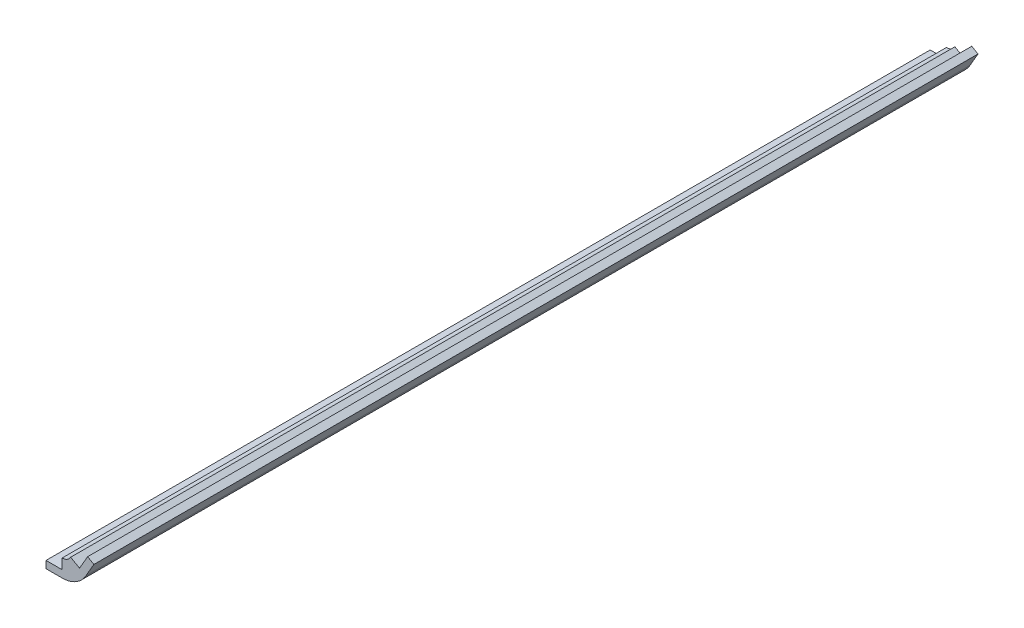
ISO-10303-21;
HEADER;
FILE_DESCRIPTION(('STEP AP214'),'2;1');
FILE_NAME('part.step','',(''),(''),'','','');
FILE_SCHEMA(('AUTOMOTIVE_DESIGN { 1 0 10303 214 1 1 1 1 }'));
ENDSEC;
DATA;
#1=APPLICATION_CONTEXT('core data for automotive mechanical design processes');
#2=APPLICATION_PROTOCOL_DEFINITION('international standard','automotive_design',2000,#1);
#3=PRODUCT_CONTEXT('',#1,'mechanical');
#4=PRODUCT('Part','Part','',(#3));
#5=PRODUCT_RELATED_PRODUCT_CATEGORY('part','',(#4));
#6=PRODUCT_DEFINITION_FORMATION('','',#4);
#7=PRODUCT_DEFINITION_CONTEXT('part definition',#1,'design');
#8=PRODUCT_DEFINITION('design','',#6,#7);
#9=PRODUCT_DEFINITION_SHAPE('','',#8);
#10=(LENGTH_UNIT() NAMED_UNIT(*) SI_UNIT(.MILLI.,.METRE.));
#11=(NAMED_UNIT(*) PLANE_ANGLE_UNIT() SI_UNIT($,.RADIAN.));
#12=(NAMED_UNIT(*) SI_UNIT($,.STERADIAN.) SOLID_ANGLE_UNIT());
#13=UNCERTAINTY_MEASURE_WITH_UNIT(LENGTH_MEASURE(1.E-05),#10,'distance_accuracy_value','');
#14=(GEOMETRIC_REPRESENTATION_CONTEXT(3) GLOBAL_UNCERTAINTY_ASSIGNED_CONTEXT((#13)) GLOBAL_UNIT_ASSIGNED_CONTEXT((#10,
#11,#12)) REPRESENTATION_CONTEXT('',''));
#15=CARTESIAN_POINT('',(0.,0.,0.));
#16=DIRECTION('',(0.,0.,1.));
#17=DIRECTION('',(1.,0.,0.));
#18=AXIS2_PLACEMENT_3D('',#15,#16,#17);
#19=CARTESIAN_POINT('',(-7.3025,-1.500000048,130.175));
#20=DIRECTION('',(1.,0.,0.));
#21=DIRECTION('',(0.,0.,-1.));
#22=AXIS2_PLACEMENT_3D('',#19,#20,#21);
#23=PLANE('',#22);
#24=DIRECTION('',(0.,-1.,0.));
#25=VECTOR('',#24,1.);
#26=CARTESIAN_POINT('',(-7.3025,-1.500000048,-130.175));
#27=LINE('',#26,#25);
#28=CARTESIAN_POINT('',(-7.3025,-1.500000048,-130.175));
#29=VERTEX_POINT('',#28);
#30=CARTESIAN_POINT('',(-7.3025,-3.621225168,-130.175));
#31=VERTEX_POINT('',#30);
#32=EDGE_CURVE('E88',#29,#31,#27,.T.);
#33=ORIENTED_EDGE('',*,*,#32,.T.);
#34=DIRECTION('',(0.,0.,-1.));
#35=VECTOR('',#34,1.);
#36=CARTESIAN_POINT('',(-7.3025,-3.621225168,130.175));
#37=LINE('',#36,#35);
#38=CARTESIAN_POINT('',(-7.3025,-3.621225168,130.175));
#39=VERTEX_POINT('',#38);
#40=EDGE_CURVE('E11',#39,#31,#37,.T.);
#41=ORIENTED_EDGE('',*,*,#40,.F.);
#42=DIRECTION('',(0.,-1.,0.));
#43=VECTOR('',#42,1.);
#44=CARTESIAN_POINT('',(-7.3025,-1.500000048,130.175));
#45=LINE('',#44,#43);
#46=CARTESIAN_POINT('',(-7.3025,-1.500000048,130.175));
#47=VERTEX_POINT('',#46);
#48=EDGE_CURVE('E82',#47,#39,#45,.T.);
#49=ORIENTED_EDGE('',*,*,#48,.F.);
#50=DIRECTION('',(0.,0.,-1.));
#51=VECTOR('',#50,1.);
#52=CARTESIAN_POINT('',(-7.3025,-1.500000048,130.175));
#53=LINE('',#52,#51);
#54=EDGE_CURVE('E77',#47,#29,#53,.T.);
#55=ORIENTED_EDGE('',*,*,#54,.T.);
#56=EDGE_LOOP('',(#33,#41,#49,#55));
#57=FACE_BOUND('',#56,.T.);
#58=ADVANCED_FACE('F37',(#57),#23,.F.);
#59=CARTESIAN_POINT('',(-7.3025,-3.621225168,130.175));
#60=DIRECTION('',(0.,1.,0.));
#61=DIRECTION('',(0.,0.,1.));
#62=AXIS2_PLACEMENT_3D('',#59,#60,#61);
#63=PLANE('',#62);
#64=DIRECTION('',(1.,0.,0.));
#65=VECTOR('',#64,1.);
#66=CARTESIAN_POINT('',(-7.3025,-3.621225168,-130.175));
#67=LINE('',#66,#65);
#68=CARTESIAN_POINT('',(-2.54,-3.621225168,-130.175));
#69=VERTEX_POINT('',#68);
#70=EDGE_CURVE('E83',#31,#69,#67,.T.);
#71=ORIENTED_EDGE('',*,*,#70,.T.);
#72=DIRECTION('',(0.,0.,-1.));
#73=VECTOR('',#72,1.);
#74=CARTESIAN_POINT('',(-2.54,-3.621225168,130.175));
#75=LINE('',#74,#73);
#76=CARTESIAN_POINT('',(-2.54,-3.621225168,130.175));
#77=VERTEX_POINT('',#76);
#78=EDGE_CURVE('E46',#77,#69,#75,.T.);
#79=ORIENTED_EDGE('',*,*,#78,.F.);
#80=DIRECTION('',(1.,0.,0.));
#81=VECTOR('',#80,1.);
#82=CARTESIAN_POINT('',(-7.3025,-3.621225168,130.175));
#83=LINE('',#82,#81);
#84=EDGE_CURVE('E130',#39,#77,#83,.T.);
#85=ORIENTED_EDGE('',*,*,#84,.F.);
#86=ORIENTED_EDGE('',*,*,#40,.T.);
#87=EDGE_LOOP('',(#71,#79,#85,#86));
#88=FACE_BOUND('',#87,.T.);
#89=ADVANCED_FACE('F129',(#88),#63,.F.);
#90=CARTESIAN_POINT('',(-7.3025,-1.500000048,130.175));
#91=DIRECTION('',(0.,-1.,0.));
#92=DIRECTION('',(1.,0.,0.));
#93=AXIS2_PLACEMENT_3D('',#90,#91,#92);
#94=PLANE('',#93);
#95=DIRECTION('',(-1.,0.,0.));
#96=VECTOR('',#95,1.);
#97=CARTESIAN_POINT('',(-7.3025,-1.500000048,-130.175));
#98=LINE('',#97,#96);
#99=CARTESIAN_POINT('',(-2.54,-1.500000048,-130.175));
#100=VERTEX_POINT('',#99);
#101=EDGE_CURVE('E74',#100,#29,#98,.T.);
#102=ORIENTED_EDGE('',*,*,#101,.T.);
#103=ORIENTED_EDGE('',*,*,#54,.F.);
#104=DIRECTION('',(-1.,0.,0.));
#105=VECTOR('',#104,1.);
#106=CARTESIAN_POINT('',(-7.3025,-1.500000048,130.175));
#107=LINE('',#106,#105);
#108=CARTESIAN_POINT('',(-2.54,-1.500000048,130.175));
#109=VERTEX_POINT('',#108);
#110=EDGE_CURVE('E54',#109,#47,#107,.T.);
#111=ORIENTED_EDGE('',*,*,#110,.F.);
#112=DIRECTION('',(0.,0.,-1.));
#113=VECTOR('',#112,1.);
#114=CARTESIAN_POINT('',(-2.54,-1.500000048,130.175));
#115=LINE('',#114,#113);
#116=EDGE_CURVE('E79',#109,#100,#115,.T.);
#117=ORIENTED_EDGE('',*,*,#116,.T.);
#118=EDGE_LOOP('',(#102,#103,#111,#117));
#119=FACE_BOUND('',#118,.T.);
#120=ADVANCED_FACE('F76',(#119),#94,.F.);
#121=CARTESIAN_POINT('',(0.,0.,130.175));
#122=DIRECTION('',(0.,0.,1.));
#123=DIRECTION('',(1.,0.,0.));
#124=AXIS2_PLACEMENT_3D('',#121,#122,#123);
#125=PLANE('',#124);
#126=DIRECTION('',(-0.499999999999998,-0.86602540378444,0.));
#127=VECTOR('',#126,1.);
#128=CARTESIAN_POINT('',(4.95028814724586,5.57415048713588,130.175));
#129=LINE('',#128,#127);
#130=CARTESIAN_POINT('',(4.95028814724586,5.57415048713588,130.175));
#131=VERTEX_POINT('',#130);
#132=CARTESIAN_POINT('',(2.56903814724587,1.44970450161248,130.175));
#133=VERTEX_POINT('',#132);
#134=EDGE_CURVE('E170',#131,#133,#129,.T.);
#135=ORIENTED_EDGE('',*,*,#134,.T.);
#136=DIRECTION('',(-0.86602540378444,0.499999999999998,0.));
#137=VECTOR('',#136,1.);
#138=CARTESIAN_POINT('',(2.56903814724587,1.44970450161248,130.175));
#139=LINE('',#138,#137);
#140=CARTESIAN_POINT('',(-0.0290381472458851,2.94970454961247,130.175));
#141=VERTEX_POINT('',#140);
#142=EDGE_CURVE('E152',#133,#141,#139,.T.);
#143=ORIENTED_EDGE('',*,*,#142,.T.);
#144=CARTESIAN_POINT('',(-2.54,4.39940905122494,130.175));
#145=DIRECTION('',(0.,0.,-1.));
#146=DIRECTION('',(-1.,0.,0.));
#147=AXIS2_PLACEMENT_3D('',#144,#145,#146);
#148=CIRCLE('',#147,2.89940900322494);
#149=CARTESIAN_POINT('',(-2.54,1.500000048,130.175));
#150=VERTEX_POINT('',#149);
#151=EDGE_CURVE('E156',#141,#150,#148,.T.);
#152=ORIENTED_EDGE('',*,*,#151,.T.);
#153=DIRECTION('',(0.,-1.,0.));
#154=VECTOR('',#153,1.);
#155=CARTESIAN_POINT('',(-2.54,1.500000048,130.175));
#156=LINE('',#155,#154);
#157=EDGE_CURVE('E179',#150,#109,#156,.T.);
#158=ORIENTED_EDGE('',*,*,#157,.T.);
#159=ORIENTED_EDGE('',*,*,#110,.T.);
#160=ORIENTED_EDGE('',*,*,#48,.T.);
#161=ORIENTED_EDGE('',*,*,#84,.T.);
#162=CARTESIAN_POINT('',(-2.54,4.39940905122494,130.175));
#163=DIRECTION('',(0.,0.,1.));
#164=DIRECTION('',(-1.,0.,0.));
#165=AXIS2_PLACEMENT_3D('',#162,#163,#164);
#166=CIRCLE('',#165,8.02063421922494);
#167=CARTESIAN_POINT('',(4.40607298831157,0.389091941612482,130.175));
#168=VERTEX_POINT('',#167);
#169=EDGE_CURVE('E120',#77,#168,#166,.T.);
#170=ORIENTED_EDGE('',*,*,#169,.T.);
#171=DIRECTION('',(0.499999999999998,0.86602540378444,0.));
#172=VECTOR('',#171,1.);
#173=CARTESIAN_POINT('',(6.78732298831156,4.51353792713588,130.175));
#174=LINE('',#173,#172);
#175=CARTESIAN_POINT('',(6.78732298831156,4.51353792713588,130.175));
#176=VERTEX_POINT('',#175);
#177=EDGE_CURVE('E175',#168,#176,#174,.T.);
#178=ORIENTED_EDGE('',*,*,#177,.T.);
#179=DIRECTION('',(-0.86602540378444,0.499999999999997,0.));
#180=VECTOR('',#179,1.);
#181=CARTESIAN_POINT('',(6.78732298831156,4.51353792713588,130.175));
#182=LINE('',#181,#180);
#183=EDGE_CURVE('E172',#176,#131,#182,.T.);
#184=ORIENTED_EDGE('',*,*,#183,.T.);
#185=EDGE_LOOP('',(#135,#143,#152,#158,#159,#160,#161,#170,#178,#184));
#186=FACE_BOUND('',#185,.T.);
#187=ADVANCED_FACE('F132',(#186),#125,.T.);
#188=CARTESIAN_POINT('',(0.,0.,-130.175));
#189=DIRECTION('',(0.,0.,1.));
#190=DIRECTION('',(1.,0.,0.));
#191=AXIS2_PLACEMENT_3D('',#188,#189,#190);
#192=PLANE('',#191);
#193=DIRECTION('',(0.499999999999998,0.86602540378444,0.));
#194=VECTOR('',#193,1.);
#195=CARTESIAN_POINT('',(6.78732298831156,4.51353792713588,-130.175));
#196=LINE('',#195,#194);
#197=CARTESIAN_POINT('',(4.40607298831157,0.389091941612482,-130.175));
#198=VERTEX_POINT('',#197);
#199=CARTESIAN_POINT('',(6.78732298831156,4.51353792713588,-130.175));
#200=VERTEX_POINT('',#199);
#201=EDGE_CURVE('E127',#198,#200,#196,.T.);
#202=ORIENTED_EDGE('',*,*,#201,.F.);
#203=CARTESIAN_POINT('',(-2.54,4.39940905122494,-130.175));
#204=DIRECTION('',(0.,0.,1.));
#205=DIRECTION('',(-1.,0.,0.));
#206=AXIS2_PLACEMENT_3D('',#203,#204,#205);
#207=CIRCLE('',#206,8.02063421922494);
#208=EDGE_CURVE('E116',#69,#198,#207,.T.);
#209=ORIENTED_EDGE('',*,*,#208,.F.);
#210=ORIENTED_EDGE('',*,*,#70,.F.);
#211=ORIENTED_EDGE('',*,*,#32,.F.);
#212=ORIENTED_EDGE('',*,*,#101,.F.);
#213=DIRECTION('',(0.,-1.,0.));
#214=VECTOR('',#213,1.);
#215=CARTESIAN_POINT('',(-2.54,1.500000048,-130.175));
#216=LINE('',#215,#214);
#217=CARTESIAN_POINT('',(-2.54,1.500000048,-130.175));
#218=VERTEX_POINT('',#217);
#219=EDGE_CURVE('E69',#218,#100,#216,.T.);
#220=ORIENTED_EDGE('',*,*,#219,.F.);
#221=CARTESIAN_POINT('',(-2.54,4.39940905122494,-130.175));
#222=DIRECTION('',(0.,0.,-1.));
#223=DIRECTION('',(-1.,0.,0.));
#224=AXIS2_PLACEMENT_3D('',#221,#222,#223);
#225=CIRCLE('',#224,2.89940900322494);
#226=CARTESIAN_POINT('',(-0.0290381472458851,2.94970454961247,-130.175));
#227=VERTEX_POINT('',#226);
#228=EDGE_CURVE('E165',#227,#218,#225,.T.);
#229=ORIENTED_EDGE('',*,*,#228,.F.);
#230=DIRECTION('',(-0.86602540378444,0.499999999999998,0.));
#231=VECTOR('',#230,1.);
#232=CARTESIAN_POINT('',(2.56903814724587,1.44970450161248,-130.175));
#233=LINE('',#232,#231);
#234=CARTESIAN_POINT('',(2.56903814724587,1.44970450161248,-130.175));
#235=VERTEX_POINT('',#234);
#236=EDGE_CURVE('E153',#235,#227,#233,.T.);
#237=ORIENTED_EDGE('',*,*,#236,.F.);
#238=DIRECTION('',(-0.499999999999998,-0.86602540378444,0.));
#239=VECTOR('',#238,1.);
#240=CARTESIAN_POINT('',(4.95028814724586,5.57415048713588,-130.175));
#241=LINE('',#240,#239);
#242=CARTESIAN_POINT('',(4.95028814724586,5.57415048713588,-130.175));
#243=VERTEX_POINT('',#242);
#244=EDGE_CURVE('E157',#243,#235,#241,.T.);
#245=ORIENTED_EDGE('',*,*,#244,.F.);
#246=DIRECTION('',(-0.86602540378444,0.499999999999997,0.));
#247=VECTOR('',#246,1.);
#248=CARTESIAN_POINT('',(6.78732298831156,4.51353792713588,-130.175));
#249=LINE('',#248,#247);
#250=EDGE_CURVE('E160',#200,#243,#249,.T.);
#251=ORIENTED_EDGE('',*,*,#250,.F.);
#252=EDGE_LOOP('',(#202,#209,#210,#211,#212,#220,#229,#237,#245,#251));
#253=FACE_BOUND('',#252,.T.);
#254=ADVANCED_FACE('F92',(#253),#192,.F.);
#255=CARTESIAN_POINT('',(-2.54,4.39940905122494,130.175));
#256=DIRECTION('',(0.,0.,-1.));
#257=DIRECTION('',(-1.,0.,0.));
#258=AXIS2_PLACEMENT_3D('',#255,#256,#257);
#259=CYLINDRICAL_SURFACE('',#258,2.89940900322494);
#260=ORIENTED_EDGE('',*,*,#228,.T.);
#261=DIRECTION('',(0.,0.,-1.));
#262=VECTOR('',#261,1.);
#263=CARTESIAN_POINT('',(-2.54,1.500000048,130.175));
#264=LINE('',#263,#262);
#265=EDGE_CURVE('E95',#150,#218,#264,.T.);
#266=ORIENTED_EDGE('',*,*,#265,.F.);
#267=ORIENTED_EDGE('',*,*,#151,.F.);
#268=DIRECTION('',(0.,0.,-1.));
#269=VECTOR('',#268,1.);
#270=CARTESIAN_POINT('',(-0.0290381472458851,2.94970454961247,130.175));
#271=LINE('',#270,#269);
#272=EDGE_CURVE('E148',#141,#227,#271,.T.);
#273=ORIENTED_EDGE('',*,*,#272,.T.);
#274=EDGE_LOOP('',(#260,#266,#267,#273));
#275=FACE_BOUND('',#274,.T.);
#276=ADVANCED_FACE('F192',(#275),#259,.F.);
#277=CARTESIAN_POINT('',(-2.54,1.500000048,130.175));
#278=DIRECTION('',(1.,0.,0.));
#279=DIRECTION('',(0.,0.,-1.));
#280=AXIS2_PLACEMENT_3D('',#277,#278,#279);
#281=PLANE('',#280);
#282=ORIENTED_EDGE('',*,*,#219,.T.);
#283=ORIENTED_EDGE('',*,*,#116,.F.);
#284=ORIENTED_EDGE('',*,*,#157,.F.);
#285=ORIENTED_EDGE('',*,*,#265,.T.);
#286=EDGE_LOOP('',(#282,#283,#284,#285));
#287=FACE_BOUND('',#286,.T.);
#288=ADVANCED_FACE('F194',(#287),#281,.F.);
#289=CARTESIAN_POINT('',(-2.54,4.39940905122494,130.175));
#290=DIRECTION('',(0.,0.,-1.));
#291=DIRECTION('',(-1.,0.,0.));
#292=AXIS2_PLACEMENT_3D('',#289,#290,#291);
#293=CYLINDRICAL_SURFACE('',#292,8.02063421922494);
#294=ORIENTED_EDGE('',*,*,#208,.T.);
#295=DIRECTION('',(0.,0.,-1.));
#296=VECTOR('',#295,1.);
#297=CARTESIAN_POINT('',(4.40607298831157,0.389091941612482,130.175));
#298=LINE('',#297,#296);
#299=EDGE_CURVE('E99',#168,#198,#298,.T.);
#300=ORIENTED_EDGE('',*,*,#299,.F.);
#301=ORIENTED_EDGE('',*,*,#169,.F.);
#302=ORIENTED_EDGE('',*,*,#78,.T.);
#303=EDGE_LOOP('',(#294,#300,#301,#302));
#304=FACE_BOUND('',#303,.T.);
#305=ADVANCED_FACE('F113',(#304),#293,.T.);
#306=CARTESIAN_POINT('',(6.78732298831156,4.51353792713588,130.175));
#307=DIRECTION('',(-0.86602540378444,0.499999999999998,0.));
#308=DIRECTION('',(-0.499999999999998,-0.86602540378444,0.));
#309=AXIS2_PLACEMENT_3D('',#306,#307,#308);
#310=PLANE('',#309);
#311=ORIENTED_EDGE('',*,*,#201,.T.);
#312=DIRECTION('',(0.,0.,-1.));
#313=VECTOR('',#312,1.);
#314=CARTESIAN_POINT('',(6.78732298831156,4.51353792713588,130.175));
#315=LINE('',#314,#313);
#316=EDGE_CURVE('E136',#176,#200,#315,.T.);
#317=ORIENTED_EDGE('',*,*,#316,.F.);
#318=ORIENTED_EDGE('',*,*,#177,.F.);
#319=ORIENTED_EDGE('',*,*,#299,.T.);
#320=EDGE_LOOP('',(#311,#317,#318,#319));
#321=FACE_BOUND('',#320,.T.);
#322=ADVANCED_FACE('F229',(#321),#310,.F.);
#323=CARTESIAN_POINT('',(6.78732298831156,4.51353792713588,130.175));
#324=DIRECTION('',(-0.499999999999997,-0.86602540378444,0.));
#325=DIRECTION('',(0.86602540378444,-0.499999999999997,0.));
#326=AXIS2_PLACEMENT_3D('',#323,#324,#325);
#327=PLANE('',#326);
#328=ORIENTED_EDGE('',*,*,#250,.T.);
#329=DIRECTION('',(0.,0.,-1.));
#330=VECTOR('',#329,1.);
#331=CARTESIAN_POINT('',(4.95028814724586,5.57415048713588,130.175));
#332=LINE('',#331,#330);
#333=EDGE_CURVE('E140',#131,#243,#332,.T.);
#334=ORIENTED_EDGE('',*,*,#333,.F.);
#335=ORIENTED_EDGE('',*,*,#183,.F.);
#336=ORIENTED_EDGE('',*,*,#316,.T.);
#337=EDGE_LOOP('',(#328,#334,#335,#336));
#338=FACE_BOUND('',#337,.T.);
#339=ADVANCED_FACE('F218',(#338),#327,.F.);
#340=CARTESIAN_POINT('',(4.95028814724586,5.57415048713588,130.175));
#341=DIRECTION('',(0.86602540378444,-0.499999999999998,0.));
#342=DIRECTION('',(0.499999999999998,0.86602540378444,0.));
#343=AXIS2_PLACEMENT_3D('',#340,#341,#342);
#344=PLANE('',#343);
#345=ORIENTED_EDGE('',*,*,#244,.T.);
#346=DIRECTION('',(0.,0.,-1.));
#347=VECTOR('',#346,1.);
#348=CARTESIAN_POINT('',(2.56903814724587,1.44970450161248,130.175));
#349=LINE('',#348,#347);
#350=EDGE_CURVE('E144',#133,#235,#349,.T.);
#351=ORIENTED_EDGE('',*,*,#350,.F.);
#352=ORIENTED_EDGE('',*,*,#134,.F.);
#353=ORIENTED_EDGE('',*,*,#333,.T.);
#354=EDGE_LOOP('',(#345,#351,#352,#353));
#355=FACE_BOUND('',#354,.T.);
#356=ADVANCED_FACE('F211',(#355),#344,.F.);
#357=CARTESIAN_POINT('',(2.56903814724587,1.44970450161248,130.175));
#358=DIRECTION('',(-0.499999999999997,-0.86602540378444,0.));
#359=DIRECTION('',(0.86602540378444,-0.499999999999998,0.));
#360=AXIS2_PLACEMENT_3D('',#357,#358,#359);
#361=PLANE('',#360);
#362=ORIENTED_EDGE('',*,*,#236,.T.);
#363=ORIENTED_EDGE('',*,*,#272,.F.);
#364=ORIENTED_EDGE('',*,*,#142,.F.);
#365=ORIENTED_EDGE('',*,*,#350,.T.);
#366=EDGE_LOOP('',(#362,#363,#364,#365));
#367=FACE_BOUND('',#366,.T.);
#368=ADVANCED_FACE('F207',(#367),#361,.F.);
#369=CLOSED_SHELL('',(#58,#89,#120,#187,#254,#276,#288,#305,#322,#339,#356,#368));
#370=MANIFOLD_SOLID_BREP('B2',#369);
#371=ADVANCED_BREP_SHAPE_REPRESENTATION('',(#18,#370),#14);
#372=SHAPE_DEFINITION_REPRESENTATION(#9,#371);
ENDSEC;
END-ISO-10303-21;
